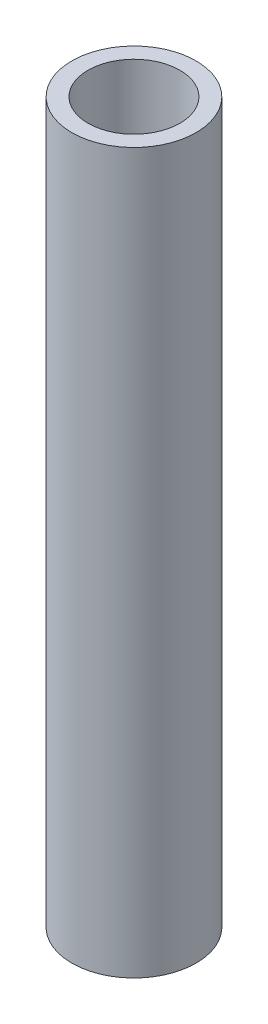
ISO-10303-21;
HEADER;
FILE_DESCRIPTION(('STEP AP214'),'2;1');
FILE_NAME('part.step','',(''),(''),'','','');
FILE_SCHEMA(('AUTOMOTIVE_DESIGN { 1 0 10303 214 1 1 1 1 }'));
ENDSEC;
DATA;
#1=APPLICATION_CONTEXT('core data for automotive mechanical design processes');
#2=APPLICATION_PROTOCOL_DEFINITION('international standard','automotive_design',2000,#1);
#3=PRODUCT_CONTEXT('',#1,'mechanical');
#4=PRODUCT('Part','Part','',(#3));
#5=PRODUCT_RELATED_PRODUCT_CATEGORY('part','',(#4));
#6=PRODUCT_DEFINITION_FORMATION('','',#4);
#7=PRODUCT_DEFINITION_CONTEXT('part definition',#1,'design');
#8=PRODUCT_DEFINITION('design','',#6,#7);
#9=PRODUCT_DEFINITION_SHAPE('','',#8);
#10=(LENGTH_UNIT() NAMED_UNIT(*) SI_UNIT(.MILLI.,.METRE.));
#11=(NAMED_UNIT(*) PLANE_ANGLE_UNIT() SI_UNIT($,.RADIAN.));
#12=(NAMED_UNIT(*) SI_UNIT($,.STERADIAN.) SOLID_ANGLE_UNIT());
#13=UNCERTAINTY_MEASURE_WITH_UNIT(LENGTH_MEASURE(1.E-05),#10,'distance_accuracy_value','');
#14=(GEOMETRIC_REPRESENTATION_CONTEXT(3) GLOBAL_UNCERTAINTY_ASSIGNED_CONTEXT((#13)) GLOBAL_UNIT_ASSIGNED_CONTEXT((#10,
#11,#12)) REPRESENTATION_CONTEXT('',''));
#15=CARTESIAN_POINT('',(0.,0.,0.));
#16=DIRECTION('',(0.,0.,1.));
#17=DIRECTION('',(1.,0.,0.));
#18=AXIS2_PLACEMENT_3D('',#15,#16,#17);
#19=CARTESIAN_POINT('',(0.,0.,0.));
#20=DIRECTION('',(0.,1.,0.));
#21=DIRECTION('',(0.,0.,1.));
#22=AXIS2_PLACEMENT_3D('',#19,#20,#21);
#23=PLANE('',#22);
#24=CARTESIAN_POINT('',(0.,0.,0.));
#25=DIRECTION('',(0.,1.,0.));
#26=DIRECTION('',(0.,0.,1.));
#27=AXIS2_PLACEMENT_3D('',#24,#25,#26);
#28=CIRCLE('',#27,19.05);
#29=CARTESIAN_POINT('',(0.,0.,19.05));
#30=VERTEX_POINT('',#29);
#31=EDGE_CURVE('E43',#30,#30,#28,.T.);
#32=ORIENTED_EDGE('',*,*,#31,.F.);
#33=EDGE_LOOP('',(#32));
#34=FACE_BOUND('',#33,.T.);
#35=CARTESIAN_POINT('',(0.,0.,0.));
#36=DIRECTION('',(0.,-1.,0.));
#37=DIRECTION('',(0.,0.,-1.));
#38=AXIS2_PLACEMENT_3D('',#35,#36,#37);
#39=CIRCLE('',#38,14.08938);
#40=CARTESIAN_POINT('',(0.,0.,-14.08938));
#41=VERTEX_POINT('',#40);
#42=EDGE_CURVE('E68',#41,#41,#39,.T.);
#43=ORIENTED_EDGE('',*,*,#42,.F.);
#44=EDGE_LOOP('',(#43));
#45=FACE_BOUND('',#44,.T.);
#46=ADVANCED_FACE('F35',(#34,#45),#23,.F.);
#47=CARTESIAN_POINT('',(0.,220.472,0.));
#48=DIRECTION('',(0.,-1.,0.));
#49=DIRECTION('',(0.,0.,-1.));
#50=AXIS2_PLACEMENT_3D('',#47,#48,#49);
#51=CYLINDRICAL_SURFACE('',#50,19.05);
#52=CARTESIAN_POINT('',(0.,220.472,0.));
#53=DIRECTION('',(0.,1.,0.));
#54=DIRECTION('',(0.,0.,1.));
#55=AXIS2_PLACEMENT_3D('',#52,#53,#54);
#56=CIRCLE('',#55,19.05);
#57=CARTESIAN_POINT('',(0.,220.472,19.05));
#58=VERTEX_POINT('',#57);
#59=EDGE_CURVE('E10',#58,#58,#56,.T.);
#60=ORIENTED_EDGE('',*,*,#59,.F.);
#61=EDGE_LOOP('',(#60));
#62=FACE_BOUND('',#61,.T.);
#63=ORIENTED_EDGE('',*,*,#31,.T.);
#64=EDGE_LOOP('',(#63));
#65=FACE_BOUND('',#64,.T.);
#66=ADVANCED_FACE('F37',(#62,#65),#51,.T.);
#67=CARTESIAN_POINT('',(0.,220.472,0.));
#68=DIRECTION('',(0.,1.,0.));
#69=DIRECTION('',(0.,0.,1.));
#70=AXIS2_PLACEMENT_3D('',#67,#68,#69);
#71=PLANE('',#70);
#72=CARTESIAN_POINT('',(0.,220.472,0.));
#73=DIRECTION('',(0.,1.,0.));
#74=DIRECTION('',(0.,0.,1.));
#75=AXIS2_PLACEMENT_3D('',#72,#73,#74);
#76=CIRCLE('',#75,14.08938);
#77=CARTESIAN_POINT('',(0.,220.472,14.08938));
#78=VERTEX_POINT('',#77);
#79=EDGE_CURVE('E57',#78,#78,#76,.T.);
#80=ORIENTED_EDGE('',*,*,#79,.F.);
#81=EDGE_LOOP('',(#80));
#82=FACE_BOUND('',#81,.T.);
#83=ORIENTED_EDGE('',*,*,#59,.T.);
#84=EDGE_LOOP('',(#83));
#85=FACE_BOUND('',#84,.T.);
#86=ADVANCED_FACE('F79',(#82,#85),#71,.T.);
#87=CARTESIAN_POINT('',(0.,0.,0.));
#88=DIRECTION('',(0.,1.,0.));
#89=DIRECTION('',(0.,0.,1.));
#90=AXIS2_PLACEMENT_3D('',#87,#88,#89);
#91=CYLINDRICAL_SURFACE('',#90,12.7);
#92=CARTESIAN_POINT('',(0.,49.8568237268645,0.));
#93=DIRECTION('',(0.,-1.,0.));
#94=DIRECTION('',(0.,0.,-1.));
#95=AXIS2_PLACEMENT_3D('',#92,#93,#94);
#96=CIRCLE('',#95,12.7);
#97=CARTESIAN_POINT('',(0.,49.8568237268645,-12.7));
#98=VERTEX_POINT('',#97);
#99=EDGE_CURVE('E39',#98,#98,#96,.T.);
#100=ORIENTED_EDGE('',*,*,#99,.T.);
#101=EDGE_LOOP('',(#100));
#102=FACE_BOUND('',#101,.T.);
#103=CARTESIAN_POINT('',(0.,170.615176273135,0.));
#104=DIRECTION('',(0.,1.,0.));
#105=DIRECTION('',(0.,0.,1.));
#106=AXIS2_PLACEMENT_3D('',#103,#104,#105);
#107=CIRCLE('',#106,12.7);
#108=CARTESIAN_POINT('',(0.,170.615176273135,12.7));
#109=VERTEX_POINT('',#108);
#110=EDGE_CURVE('E48',#109,#109,#107,.T.);
#111=ORIENTED_EDGE('',*,*,#110,.T.);
#112=EDGE_LOOP('',(#111));
#113=FACE_BOUND('',#112,.T.);
#114=ADVANCED_FACE('F85',(#102,#113),#91,.F.);
#115=CARTESIAN_POINT('',(0.,171.45,0.));
#116=DIRECTION('',(0.,1.,0.));
#117=DIRECTION('',(0.,0.,1.));
#118=AXIS2_PLACEMENT_3D('',#115,#116,#117);
#119=CONICAL_SURFACE('',#118,14.08938,1.02974425867665);
#120=CARTESIAN_POINT('',(0.,171.45,0.));
#121=DIRECTION('',(0.,1.,0.));
#122=DIRECTION('',(0.,0.,1.));
#123=AXIS2_PLACEMENT_3D('',#120,#121,#122);
#124=CIRCLE('',#123,14.08938);
#125=CARTESIAN_POINT('',(0.,171.45,14.08938));
#126=VERTEX_POINT('',#125);
#127=EDGE_CURVE('E51',#126,#126,#124,.T.);
#128=ORIENTED_EDGE('',*,*,#127,.T.);
#129=EDGE_LOOP('',(#128));
#130=FACE_BOUND('',#129,.T.);
#131=ORIENTED_EDGE('',*,*,#110,.F.);
#132=EDGE_LOOP('',(#131));
#133=FACE_BOUND('',#132,.T.);
#134=ADVANCED_FACE('F89',(#130,#133),#119,.F.);
#135=CARTESIAN_POINT('',(0.,220.472,0.));
#136=DIRECTION('',(0.,1.,0.));
#137=DIRECTION('',(0.,0.,1.));
#138=AXIS2_PLACEMENT_3D('',#135,#136,#137);
#139=CYLINDRICAL_SURFACE('',#138,14.08938);
#140=ORIENTED_EDGE('',*,*,#127,.F.);
#141=EDGE_LOOP('',(#140));
#142=FACE_BOUND('',#141,.T.);
#143=ORIENTED_EDGE('',*,*,#79,.T.);
#144=EDGE_LOOP('',(#143));
#145=FACE_BOUND('',#144,.T.);
#146=ADVANCED_FACE('F93',(#142,#145),#139,.F.);
#147=CARTESIAN_POINT('',(0.,49.022,0.));
#148=DIRECTION('',(0.,-1.,0.));
#149=DIRECTION('',(0.,0.,-1.));
#150=AXIS2_PLACEMENT_3D('',#147,#148,#149);
#151=CONICAL_SURFACE('',#150,14.08938,1.02974425867665);
#152=CARTESIAN_POINT('',(0.,49.022,0.));
#153=DIRECTION('',(0.,-1.,0.));
#154=DIRECTION('',(0.,0.,-1.));
#155=AXIS2_PLACEMENT_3D('',#152,#153,#154);
#156=CIRCLE('',#155,14.08938);
#157=CARTESIAN_POINT('',(0.,49.022,-14.08938));
#158=VERTEX_POINT('',#157);
#159=EDGE_CURVE('E64',#158,#158,#156,.T.);
#160=ORIENTED_EDGE('',*,*,#159,.T.);
#161=EDGE_LOOP('',(#160));
#162=FACE_BOUND('',#161,.T.);
#163=ORIENTED_EDGE('',*,*,#99,.F.);
#164=EDGE_LOOP('',(#163));
#165=FACE_BOUND('',#164,.T.);
#166=ADVANCED_FACE('F96',(#162,#165),#151,.F.);
#167=CARTESIAN_POINT('',(0.,0.,0.));
#168=DIRECTION('',(0.,-1.,0.));
#169=DIRECTION('',(0.,0.,-1.));
#170=AXIS2_PLACEMENT_3D('',#167,#168,#169);
#171=CYLINDRICAL_SURFACE('',#170,14.08938);
#172=ORIENTED_EDGE('',*,*,#159,.F.);
#173=EDGE_LOOP('',(#172));
#174=FACE_BOUND('',#173,.T.);
#175=ORIENTED_EDGE('',*,*,#42,.T.);
#176=EDGE_LOOP('',(#175));
#177=FACE_BOUND('',#176,.T.);
#178=ADVANCED_FACE('F72',(#174,#177),#171,.F.);
#179=CLOSED_SHELL('',(#46,#66,#86,#114,#134,#146,#166,#178));
#180=MANIFOLD_SOLID_BREP('B2',#179);
#181=ADVANCED_BREP_SHAPE_REPRESENTATION('',(#18,#180),#14);
#182=SHAPE_DEFINITION_REPRESENTATION(#9,#181);
ENDSEC;
END-ISO-10303-21;
